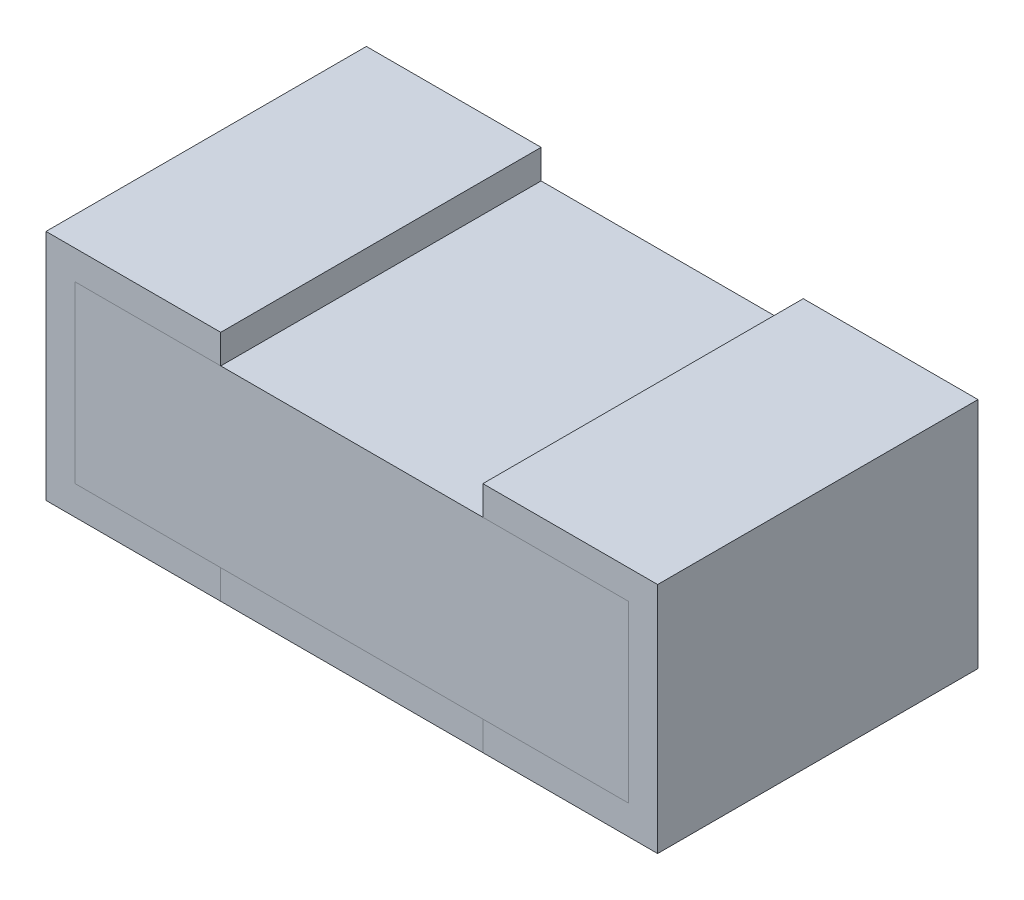
ISO-10303-21;
HEADER;
FILE_DESCRIPTION(('STEP AP214'),'2;1');
FILE_NAME('part.step','',(''),(''),'','','');
FILE_SCHEMA(('AUTOMOTIVE_DESIGN { 1 0 10303 214 1 1 1 1 }'));
ENDSEC;
DATA;
#1=APPLICATION_CONTEXT('core data for automotive mechanical design processes');
#2=APPLICATION_PROTOCOL_DEFINITION('international standard','automotive_design',2000,#1);
#3=PRODUCT_CONTEXT('',#1,'mechanical');
#4=PRODUCT('Part','Part','',(#3));
#5=PRODUCT_RELATED_PRODUCT_CATEGORY('part','',(#4));
#6=PRODUCT_DEFINITION_FORMATION('','',#4);
#7=PRODUCT_DEFINITION_CONTEXT('part definition',#1,'design');
#8=PRODUCT_DEFINITION('design','',#6,#7);
#9=PRODUCT_DEFINITION_SHAPE('','',#8);
#10=(LENGTH_UNIT() NAMED_UNIT(*) SI_UNIT(.MILLI.,.METRE.));
#11=(NAMED_UNIT(*) PLANE_ANGLE_UNIT() SI_UNIT($,.RADIAN.));
#12=(NAMED_UNIT(*) SI_UNIT($,.STERADIAN.) SOLID_ANGLE_UNIT());
#13=UNCERTAINTY_MEASURE_WITH_UNIT(LENGTH_MEASURE(1.E-05),#10,'distance_accuracy_value','');
#14=(GEOMETRIC_REPRESENTATION_CONTEXT(3) GLOBAL_UNCERTAINTY_ASSIGNED_CONTEXT((#13)) GLOBAL_UNIT_ASSIGNED_CONTEXT((#10,
#11,#12)) REPRESENTATION_CONTEXT('',''));
#15=CARTESIAN_POINT('',(0.,0.,0.));
#16=DIRECTION('',(0.,0.,1.));
#17=DIRECTION('',(1.,0.,0.));
#18=AXIS2_PLACEMENT_3D('',#15,#16,#17);
#19=CARTESIAN_POINT('',(0.999999999976395,0.35000000005278,0.));
#20=DIRECTION('',(1.,0.,0.));
#21=DIRECTION('',(0.,0.,-1.));
#22=AXIS2_PLACEMENT_3D('',#19,#20,#21);
#23=PLANE('',#22);
#24=DIRECTION('',(0.,1.,0.));
#25=VECTOR('',#24,1.);
#26=CARTESIAN_POINT('',(0.999999999976395,0.35000000005278,0.55));
#27=LINE('',#26,#25);
#28=CARTESIAN_POINT('',(0.999999999976395,0.049999999987449,0.55));
#29=VERTEX_POINT('',#28);
#30=CARTESIAN_POINT('',(0.999999999976395,0.35000000005278,0.55));
#31=VERTEX_POINT('',#30);
#32=EDGE_CURVE('E110',#29,#31,#27,.T.);
#33=ORIENTED_EDGE('',*,*,#32,.F.);
#34=DIRECTION('',(0.,0.,1.));
#35=VECTOR('',#34,1.);
#36=CARTESIAN_POINT('',(0.999999999976395,0.049999999987449,0.));
#37=LINE('',#36,#35);
#38=CARTESIAN_POINT('',(0.999999999976395,0.049999999987449,0.));
#39=VERTEX_POINT('',#38);
#40=EDGE_CURVE('E12',#39,#29,#37,.T.);
#41=ORIENTED_EDGE('',*,*,#40,.F.);
#42=DIRECTION('',(0.,1.,0.));
#43=VECTOR('',#42,1.);
#44=CARTESIAN_POINT('',(0.999999999976395,0.35000000005278,0.));
#45=LINE('',#44,#43);
#46=CARTESIAN_POINT('',(0.999999999976395,0.35000000005278,0.));
#47=VERTEX_POINT('',#46);
#48=EDGE_CURVE('E104',#39,#47,#45,.T.);
#49=ORIENTED_EDGE('',*,*,#48,.T.);
#50=DIRECTION('',(0.,0.,1.));
#51=VECTOR('',#50,1.);
#52=CARTESIAN_POINT('',(0.999999999976395,0.35000000005278,0.));
#53=LINE('',#52,#51);
#54=EDGE_CURVE('E49',#47,#31,#53,.T.);
#55=ORIENTED_EDGE('',*,*,#54,.T.);
#56=EDGE_LOOP('',(#33,#41,#49,#55));
#57=FACE_BOUND('',#56,.T.);
#58=ADVANCED_FACE('F46',(#57),#23,.T.);
#59=CARTESIAN_POINT('',(0.999999999976395,0.049999999987449,0.));
#60=DIRECTION('',(0.,-1.,0.));
#61=DIRECTION('',(0.,0.,-1.));
#62=AXIS2_PLACEMENT_3D('',#59,#60,#61);
#63=PLANE('',#62);
#64=DIRECTION('',(1.,0.,0.));
#65=VECTOR('',#64,1.);
#66=CARTESIAN_POINT('',(0.999999999976395,0.049999999987449,0.55));
#67=LINE('',#66,#65);
#68=CARTESIAN_POINT('',(0.0499999999873935,0.049999999987449,0.55));
#69=VERTEX_POINT('',#68);
#70=EDGE_CURVE('E106',#69,#29,#67,.T.);
#71=ORIENTED_EDGE('',*,*,#70,.F.);
#72=DIRECTION('',(0.,0.,1.));
#73=VECTOR('',#72,1.);
#74=CARTESIAN_POINT('',(0.0499999999873935,0.049999999987449,0.));
#75=LINE('',#74,#73);
#76=CARTESIAN_POINT('',(0.0499999999873935,0.049999999987449,0.));
#77=VERTEX_POINT('',#76);
#78=EDGE_CURVE('E55',#77,#69,#75,.T.);
#79=ORIENTED_EDGE('',*,*,#78,.F.);
#80=DIRECTION('',(1.,0.,0.));
#81=VECTOR('',#80,1.);
#82=CARTESIAN_POINT('',(0.999999999976395,0.049999999987449,0.));
#83=LINE('',#82,#81);
#84=EDGE_CURVE('E101',#77,#39,#83,.T.);
#85=ORIENTED_EDGE('',*,*,#84,.T.);
#86=ORIENTED_EDGE('',*,*,#40,.T.);
#87=EDGE_LOOP('',(#71,#79,#85,#86));
#88=FACE_BOUND('',#87,.T.);
#89=ADVANCED_FACE('F120',(#88),#63,.T.);
#90=CARTESIAN_POINT('',(0.0499999999873935,0.049999999987449,0.));
#91=DIRECTION('',(-1.,0.,0.));
#92=DIRECTION('',(0.,0.,1.));
#93=AXIS2_PLACEMENT_3D('',#90,#91,#92);
#94=PLANE('',#93);
#95=DIRECTION('',(0.,-1.,0.));
#96=VECTOR('',#95,1.);
#97=CARTESIAN_POINT('',(0.0499999999873935,0.049999999987449,0.55));
#98=LINE('',#97,#96);
#99=CARTESIAN_POINT('',(0.0499999999873935,0.350000000039305,0.55));
#100=VERTEX_POINT('',#99);
#101=EDGE_CURVE('E96',#100,#69,#98,.T.);
#102=ORIENTED_EDGE('',*,*,#101,.F.);
#103=DIRECTION('',(0.,0.,1.));
#104=VECTOR('',#103,1.);
#105=CARTESIAN_POINT('',(0.0499999999873935,0.350000000039305,0.));
#106=LINE('',#105,#104);
#107=CARTESIAN_POINT('',(0.0499999999873935,0.350000000039305,0.));
#108=VERTEX_POINT('',#107);
#109=EDGE_CURVE('E91',#108,#100,#106,.T.);
#110=ORIENTED_EDGE('',*,*,#109,.F.);
#111=DIRECTION('',(0.,-1.,0.));
#112=VECTOR('',#111,1.);
#113=CARTESIAN_POINT('',(0.0499999999873935,0.049999999987449,0.));
#114=LINE('',#113,#112);
#115=EDGE_CURVE('E94',#108,#77,#114,.T.);
#116=ORIENTED_EDGE('',*,*,#115,.T.);
#117=ORIENTED_EDGE('',*,*,#78,.T.);
#118=EDGE_LOOP('',(#102,#110,#116,#117));
#119=FACE_BOUND('',#118,.T.);
#120=ADVANCED_FACE('F93',(#119),#94,.T.);
#121=CARTESIAN_POINT('',(0.0499999999873935,0.350000000039305,0.));
#122=DIRECTION('',(-1.41845599595198E-11,1.,0.));
#123=DIRECTION('',(-1.,-1.41845599595198E-11,0.));
#124=AXIS2_PLACEMENT_3D('',#121,#122,#123);
#125=PLANE('',#124);
#126=DIRECTION('',(-1.,-1.41845599595198E-11,0.));
#127=VECTOR('',#126,1.);
#128=CARTESIAN_POINT('',(0.0499999999873935,0.350000000039305,0.55));
#129=LINE('',#128,#127);
#130=EDGE_CURVE('E113',#31,#100,#129,.T.);
#131=ORIENTED_EDGE('',*,*,#130,.F.);
#132=ORIENTED_EDGE('',*,*,#54,.F.);
#133=DIRECTION('',(-1.,-1.41845599595198E-11,0.));
#134=VECTOR('',#133,1.);
#135=CARTESIAN_POINT('',(0.0499999999873935,0.350000000039305,0.));
#136=LINE('',#135,#134);
#137=EDGE_CURVE('E100',#47,#108,#136,.T.);
#138=ORIENTED_EDGE('',*,*,#137,.T.);
#139=ORIENTED_EDGE('',*,*,#109,.T.);
#140=EDGE_LOOP('',(#131,#132,#138,#139));
#141=FACE_BOUND('',#140,.T.);
#142=ADVANCED_FACE('F103',(#141),#125,.T.);
#143=CARTESIAN_POINT('',(0.,0.,0.));
#144=DIRECTION('',(0.,0.,-1.));
#145=DIRECTION('',(-1.,0.,0.));
#146=AXIS2_PLACEMENT_3D('',#143,#144,#145);
#147=PLANE('',#146);
#148=ORIENTED_EDGE('',*,*,#48,.F.);
#149=ORIENTED_EDGE('',*,*,#84,.F.);
#150=ORIENTED_EDGE('',*,*,#115,.F.);
#151=ORIENTED_EDGE('',*,*,#137,.F.);
#152=EDGE_LOOP('',(#148,#149,#150,#151));
#153=FACE_BOUND('',#152,.T.);
#154=ADVANCED_FACE('F99',(#153),#147,.T.);
#155=CARTESIAN_POINT('',(0.,0.,0.55));
#156=DIRECTION('',(0.,0.,-1.));
#157=DIRECTION('',(-1.,0.,0.));
#158=AXIS2_PLACEMENT_3D('',#155,#156,#157);
#159=PLANE('',#158);
#160=ORIENTED_EDGE('',*,*,#32,.T.);
#161=ORIENTED_EDGE('',*,*,#130,.T.);
#162=ORIENTED_EDGE('',*,*,#101,.T.);
#163=ORIENTED_EDGE('',*,*,#70,.T.);
#164=EDGE_LOOP('',(#160,#161,#162,#163));
#165=FACE_BOUND('',#164,.T.);
#166=ADVANCED_FACE('F119',(#165),#159,.F.);
#167=CLOSED_SHELL('',(#58,#89,#120,#142,#154,#166));
#168=MANIFOLD_SOLID_BREP('B2',#167);
#169=CARTESIAN_POINT('',(0.749999999982299,0.049999999987449,0.));
#170=DIRECTION('',(1.,0.,0.));
#171=DIRECTION('',(0.,0.,-1.));
#172=AXIS2_PLACEMENT_3D('',#169,#170,#171);
#173=PLANE('',#172);
#174=DIRECTION('',(0.,1.,0.));
#175=VECTOR('',#174,1.);
#176=CARTESIAN_POINT('',(0.749999999982299,0.049999999987449,0.55));
#177=LINE('',#176,#175);
#178=CARTESIAN_POINT('',(0.749999999982299,0.,0.55));
#179=VERTEX_POINT('',#178);
#180=CARTESIAN_POINT('',(0.749999999982299,0.049999999987449,0.55));
#181=VERTEX_POINT('',#180);
#182=EDGE_CURVE('E244',#179,#181,#177,.T.);
#183=ORIENTED_EDGE('',*,*,#182,.F.);
#184=DIRECTION('',(0.,0.,1.));
#185=VECTOR('',#184,1.);
#186=CARTESIAN_POINT('',(0.749999999982299,0.,0.));
#187=LINE('',#186,#185);
#188=CARTESIAN_POINT('',(0.749999999982299,0.,0.));
#189=VERTEX_POINT('',#188);
#190=EDGE_CURVE('E44',#189,#179,#187,.T.);
#191=ORIENTED_EDGE('',*,*,#190,.F.);
#192=DIRECTION('',(0.,1.,0.));
#193=VECTOR('',#192,1.);
#194=CARTESIAN_POINT('',(0.749999999982299,0.049999999987449,0.));
#195=LINE('',#194,#193);
#196=CARTESIAN_POINT('',(0.749999999982299,0.049999999987449,0.));
#197=VERTEX_POINT('',#196);
#198=EDGE_CURVE('E238',#189,#197,#195,.T.);
#199=ORIENTED_EDGE('',*,*,#198,.T.);
#200=DIRECTION('',(0.,0.,1.));
#201=VECTOR('',#200,1.);
#202=CARTESIAN_POINT('',(0.749999999982299,0.049999999987449,0.));
#203=LINE('',#202,#201);
#204=EDGE_CURVE('E183',#197,#181,#203,.T.);
#205=ORIENTED_EDGE('',*,*,#204,.T.);
#206=EDGE_LOOP('',(#183,#191,#199,#205));
#207=FACE_BOUND('',#206,.T.);
#208=ADVANCED_FACE('F180',(#207),#173,.T.);
#209=CARTESIAN_POINT('',(0.749999999982299,0.,0.));
#210=DIRECTION('',(0.,-1.,0.));
#211=DIRECTION('',(0.,0.,-1.));
#212=AXIS2_PLACEMENT_3D('',#209,#210,#211);
#213=PLANE('',#212);
#214=DIRECTION('',(1.,0.,0.));
#215=VECTOR('',#214,1.);
#216=CARTESIAN_POINT('',(0.749999999982299,0.,0.55));
#217=LINE('',#216,#215);
#218=CARTESIAN_POINT('',(0.299999999981496,0.,0.55));
#219=VERTEX_POINT('',#218);
#220=EDGE_CURVE('E240',#219,#179,#217,.T.);
#221=ORIENTED_EDGE('',*,*,#220,.F.);
#222=DIRECTION('',(0.,0.,1.));
#223=VECTOR('',#222,1.);
#224=CARTESIAN_POINT('',(0.299999999981496,0.,0.));
#225=LINE('',#224,#223);
#226=CARTESIAN_POINT('',(0.299999999981496,0.,0.));
#227=VERTEX_POINT('',#226);
#228=EDGE_CURVE('E189',#227,#219,#225,.T.);
#229=ORIENTED_EDGE('',*,*,#228,.F.);
#230=DIRECTION('',(1.,0.,0.));
#231=VECTOR('',#230,1.);
#232=CARTESIAN_POINT('',(0.749999999982299,0.,0.));
#233=LINE('',#232,#231);
#234=EDGE_CURVE('E235',#227,#189,#233,.T.);
#235=ORIENTED_EDGE('',*,*,#234,.T.);
#236=ORIENTED_EDGE('',*,*,#190,.T.);
#237=EDGE_LOOP('',(#221,#229,#235,#236));
#238=FACE_BOUND('',#237,.T.);
#239=ADVANCED_FACE('F254',(#238),#213,.T.);
#240=CARTESIAN_POINT('',(0.299999999981496,0.,0.));
#241=DIRECTION('',(-1.,0.,0.));
#242=DIRECTION('',(0.,0.,1.));
#243=AXIS2_PLACEMENT_3D('',#240,#241,#242);
#244=PLANE('',#243);
#245=DIRECTION('',(0.,-1.,0.));
#246=VECTOR('',#245,1.);
#247=CARTESIAN_POINT('',(0.299999999981496,0.,0.55));
#248=LINE('',#247,#246);
#249=CARTESIAN_POINT('',(0.299999999981496,0.049999999987449,0.55));
#250=VERTEX_POINT('',#249);
#251=EDGE_CURVE('E230',#250,#219,#248,.T.);
#252=ORIENTED_EDGE('',*,*,#251,.F.);
#253=DIRECTION('',(0.,0.,1.));
#254=VECTOR('',#253,1.);
#255=CARTESIAN_POINT('',(0.299999999981496,0.049999999987449,0.));
#256=LINE('',#255,#254);
#257=CARTESIAN_POINT('',(0.299999999981496,0.049999999987449,0.));
#258=VERTEX_POINT('',#257);
#259=EDGE_CURVE('E225',#258,#250,#256,.T.);
#260=ORIENTED_EDGE('',*,*,#259,.F.);
#261=DIRECTION('',(0.,-1.,0.));
#262=VECTOR('',#261,1.);
#263=CARTESIAN_POINT('',(0.299999999981496,0.,0.));
#264=LINE('',#263,#262);
#265=EDGE_CURVE('E228',#258,#227,#264,.T.);
#266=ORIENTED_EDGE('',*,*,#265,.T.);
#267=ORIENTED_EDGE('',*,*,#228,.T.);
#268=EDGE_LOOP('',(#252,#260,#266,#267));
#269=FACE_BOUND('',#268,.T.);
#270=ADVANCED_FACE('F227',(#269),#244,.T.);
#271=CARTESIAN_POINT('',(0.299999999981496,0.049999999987449,0.));
#272=DIRECTION('',(0.,1.,0.));
#273=DIRECTION('',(0.,0.,1.));
#274=AXIS2_PLACEMENT_3D('',#271,#272,#273);
#275=PLANE('',#274);
#276=DIRECTION('',(-1.,0.,0.));
#277=VECTOR('',#276,1.);
#278=CARTESIAN_POINT('',(0.299999999981496,0.049999999987449,0.55));
#279=LINE('',#278,#277);
#280=EDGE_CURVE('E247',#181,#250,#279,.T.);
#281=ORIENTED_EDGE('',*,*,#280,.F.);
#282=ORIENTED_EDGE('',*,*,#204,.F.);
#283=DIRECTION('',(-1.,0.,0.));
#284=VECTOR('',#283,1.);
#285=CARTESIAN_POINT('',(0.299999999981496,0.049999999987449,0.));
#286=LINE('',#285,#284);
#287=EDGE_CURVE('E234',#197,#258,#286,.T.);
#288=ORIENTED_EDGE('',*,*,#287,.T.);
#289=ORIENTED_EDGE('',*,*,#259,.T.);
#290=EDGE_LOOP('',(#281,#282,#288,#289));
#291=FACE_BOUND('',#290,.T.);
#292=ADVANCED_FACE('F237',(#291),#275,.T.);
#293=CARTESIAN_POINT('',(0.,0.,0.));
#294=DIRECTION('',(0.,0.,-1.));
#295=DIRECTION('',(-1.,0.,0.));
#296=AXIS2_PLACEMENT_3D('',#293,#294,#295);
#297=PLANE('',#296);
#298=ORIENTED_EDGE('',*,*,#198,.F.);
#299=ORIENTED_EDGE('',*,*,#234,.F.);
#300=ORIENTED_EDGE('',*,*,#265,.F.);
#301=ORIENTED_EDGE('',*,*,#287,.F.);
#302=EDGE_LOOP('',(#298,#299,#300,#301));
#303=FACE_BOUND('',#302,.T.);
#304=ADVANCED_FACE('F233',(#303),#297,.T.);
#305=CARTESIAN_POINT('',(0.,0.,0.55));
#306=DIRECTION('',(0.,0.,-1.));
#307=DIRECTION('',(-1.,0.,0.));
#308=AXIS2_PLACEMENT_3D('',#305,#306,#307);
#309=PLANE('',#308);
#310=ORIENTED_EDGE('',*,*,#182,.T.);
#311=ORIENTED_EDGE('',*,*,#280,.T.);
#312=ORIENTED_EDGE('',*,*,#251,.T.);
#313=ORIENTED_EDGE('',*,*,#220,.T.);
#314=EDGE_LOOP('',(#310,#311,#312,#313));
#315=FACE_BOUND('',#314,.T.);
#316=ADVANCED_FACE('F253',(#315),#309,.F.);
#317=CLOSED_SHELL('',(#208,#239,#270,#292,#304,#316));
#318=MANIFOLD_SOLID_BREP('B6',#317);
#319=CARTESIAN_POINT('',(0.749999999982299,0.400000000040229,0.55));
#320=DIRECTION('',(1.,0.,0.));
#321=DIRECTION('',(0.,0.,-1.));
#322=AXIS2_PLACEMENT_3D('',#319,#320,#321);
#323=PLANE('',#322);
#324=DIRECTION('',(0.,-1.,0.));
#325=VECTOR('',#324,1.);
#326=CARTESIAN_POINT('',(0.749999999982299,0.400000000040229,0.));
#327=LINE('',#326,#325);
#328=CARTESIAN_POINT('',(0.749999999982299,0.400000000040229,0.));
#329=VERTEX_POINT('',#328);
#330=CARTESIAN_POINT('',(0.749999999982299,0.35000000005278,0.));
#331=VERTEX_POINT('',#330);
#332=EDGE_CURVE('E409',#329,#331,#327,.T.);
#333=ORIENTED_EDGE('',*,*,#332,.T.);
#334=DIRECTION('',(0.,0.,-1.));
#335=VECTOR('',#334,1.);
#336=CARTESIAN_POINT('',(0.749999999982299,0.35000000005278,0.55));
#337=LINE('',#336,#335);
#338=CARTESIAN_POINT('',(0.749999999982299,0.35000000005278,0.55));
#339=VERTEX_POINT('',#338);
#340=EDGE_CURVE('E178',#339,#331,#337,.T.);
#341=ORIENTED_EDGE('',*,*,#340,.F.);
#342=DIRECTION('',(0.,-1.,0.));
#343=VECTOR('',#342,1.);
#344=CARTESIAN_POINT('',(0.749999999982299,0.400000000040229,0.55));
#345=LINE('',#344,#343);
#346=CARTESIAN_POINT('',(0.749999999982299,0.400000000040229,0.55));
#347=VERTEX_POINT('',#346);
#348=EDGE_CURVE('E423',#347,#339,#345,.T.);
#349=ORIENTED_EDGE('',*,*,#348,.F.);
#350=DIRECTION('',(0.,0.,-1.));
#351=VECTOR('',#350,1.);
#352=CARTESIAN_POINT('',(0.749999999982299,0.400000000040229,0.55));
#353=LINE('',#352,#351);
#354=EDGE_CURVE('E405',#347,#329,#353,.T.);
#355=ORIENTED_EDGE('',*,*,#354,.T.);
#356=EDGE_LOOP('',(#333,#341,#349,#355));
#357=FACE_BOUND('',#356,.T.);
#358=ADVANCED_FACE('F313',(#357),#323,.F.);
#359=CARTESIAN_POINT('',(0.749999999982299,0.35000000005278,0.55));
#360=DIRECTION('',(0.,1.,0.));
#361=DIRECTION('',(0.,0.,1.));
#362=AXIS2_PLACEMENT_3D('',#359,#360,#361);
#363=PLANE('',#362);
#364=DIRECTION('',(1.,0.,0.));
#365=VECTOR('',#364,1.);
#366=CARTESIAN_POINT('',(0.749999999982299,0.35000000005278,0.));
#367=LINE('',#366,#365);
#368=CARTESIAN_POINT('',(0.999999999976395,0.35000000005278,0.));
#369=VERTEX_POINT('',#368);
#370=EDGE_CURVE('E412',#331,#369,#367,.T.);
#371=ORIENTED_EDGE('',*,*,#370,.T.);
#372=DIRECTION('',(0.,0.,-1.));
#373=VECTOR('',#372,1.);
#374=CARTESIAN_POINT('',(0.999999999976395,0.35000000005278,0.55));
#375=LINE('',#374,#373);
#376=CARTESIAN_POINT('',(0.999999999976395,0.35000000005278,0.55));
#377=VERTEX_POINT('',#376);
#378=EDGE_CURVE('E321',#377,#369,#375,.T.);
#379=ORIENTED_EDGE('',*,*,#378,.F.);
#380=DIRECTION('',(1.,0.,0.));
#381=VECTOR('',#380,1.);
#382=CARTESIAN_POINT('',(0.749999999982299,0.35000000005278,0.55));
#383=LINE('',#382,#381);
#384=EDGE_CURVE('E372',#339,#377,#383,.T.);
#385=ORIENTED_EDGE('',*,*,#384,.F.);
#386=ORIENTED_EDGE('',*,*,#340,.T.);
#387=EDGE_LOOP('',(#371,#379,#385,#386));
#388=FACE_BOUND('',#387,.T.);
#389=ADVANCED_FACE('F458',(#388),#363,.F.);
#390=CARTESIAN_POINT('',(0.999999999976395,0.35000000005278,0.55));
#391=DIRECTION('',(1.,0.,0.));
#392=DIRECTION('',(0.,0.,-1.));
#393=AXIS2_PLACEMENT_3D('',#390,#391,#392);
#394=PLANE('',#393);
#395=DIRECTION('',(0.,-1.,0.));
#396=VECTOR('',#395,1.);
#397=CARTESIAN_POINT('',(0.999999999976395,0.35000000005278,0.));
#398=LINE('',#397,#396);
#399=CARTESIAN_POINT('',(0.999999999976395,0.049999999987449,0.));
#400=VERTEX_POINT('',#399);
#401=EDGE_CURVE('E414',#369,#400,#398,.T.);
#402=ORIENTED_EDGE('',*,*,#401,.T.);
#403=DIRECTION('',(0.,0.,-1.));
#404=VECTOR('',#403,1.);
#405=CARTESIAN_POINT('',(0.999999999976395,0.049999999987449,0.55));
#406=LINE('',#405,#404);
#407=CARTESIAN_POINT('',(0.999999999976395,0.049999999987449,0.55));
#408=VERTEX_POINT('',#407);
#409=EDGE_CURVE('E430',#408,#400,#406,.T.);
#410=ORIENTED_EDGE('',*,*,#409,.F.);
#411=DIRECTION('',(0.,-1.,0.));
#412=VECTOR('',#411,1.);
#413=CARTESIAN_POINT('',(0.999999999976395,0.35000000005278,0.55));
#414=LINE('',#413,#412);
#415=EDGE_CURVE('E438',#377,#408,#414,.T.);
#416=ORIENTED_EDGE('',*,*,#415,.F.);
#417=ORIENTED_EDGE('',*,*,#378,.T.);
#418=EDGE_LOOP('',(#402,#410,#416,#417));
#419=FACE_BOUND('',#418,.T.);
#420=ADVANCED_FACE('F436',(#419),#394,.F.);
#421=CARTESIAN_POINT('',(0.999999999976395,0.049999999987449,0.55));
#422=DIRECTION('',(0.,-1.,0.));
#423=DIRECTION('',(0.,0.,-1.));
#424=AXIS2_PLACEMENT_3D('',#421,#422,#423);
#425=PLANE('',#424);
#426=DIRECTION('',(-1.,0.,0.));
#427=VECTOR('',#426,1.);
#428=CARTESIAN_POINT('',(0.999999999976395,0.049999999987449,0.));
#429=LINE('',#428,#427);
#430=CARTESIAN_POINT('',(0.749999999982299,0.049999999987449,0.));
#431=VERTEX_POINT('',#430);
#432=EDGE_CURVE('E416',#400,#431,#429,.T.);
#433=ORIENTED_EDGE('',*,*,#432,.T.);
#434=DIRECTION('',(0.,0.,-1.));
#435=VECTOR('',#434,1.);
#436=CARTESIAN_POINT('',(0.749999999982299,0.049999999987449,0.55));
#437=LINE('',#436,#435);
#438=CARTESIAN_POINT('',(0.749999999982299,0.049999999987449,0.55));
#439=VERTEX_POINT('',#438);
#440=EDGE_CURVE('E427',#439,#431,#437,.T.);
#441=ORIENTED_EDGE('',*,*,#440,.F.);
#442=DIRECTION('',(-1.,0.,0.));
#443=VECTOR('',#442,1.);
#444=CARTESIAN_POINT('',(0.999999999976395,0.049999999987449,0.55));
#445=LINE('',#444,#443);
#446=EDGE_CURVE('E450',#408,#439,#445,.T.);
#447=ORIENTED_EDGE('',*,*,#446,.F.);
#448=ORIENTED_EDGE('',*,*,#409,.T.);
#449=EDGE_LOOP('',(#433,#441,#447,#448));
#450=FACE_BOUND('',#449,.T.);
#451=ADVANCED_FACE('F446',(#450),#425,.F.);
#452=CARTESIAN_POINT('',(0.749999999982299,0.049999999987449,0.55));
#453=DIRECTION('',(1.,0.,0.));
#454=DIRECTION('',(0.,0.,-1.));
#455=AXIS2_PLACEMENT_3D('',#452,#453,#454);
#456=PLANE('',#455);
#457=DIRECTION('',(0.,-1.,0.));
#458=VECTOR('',#457,1.);
#459=CARTESIAN_POINT('',(0.749999999982299,0.049999999987449,0.));
#460=LINE('',#459,#458);
#461=CARTESIAN_POINT('',(0.749999999982299,0.,0.));
#462=VERTEX_POINT('',#461);
#463=EDGE_CURVE('E418',#431,#462,#460,.T.);
#464=ORIENTED_EDGE('',*,*,#463,.T.);
#465=DIRECTION('',(0.,0.,-1.));
#466=VECTOR('',#465,1.);
#467=CARTESIAN_POINT('',(0.749999999982299,0.,0.55));
#468=LINE('',#467,#466);
#469=CARTESIAN_POINT('',(0.749999999982299,0.,0.55));
#470=VERTEX_POINT('',#469);
#471=EDGE_CURVE('E400',#470,#462,#468,.T.);
#472=ORIENTED_EDGE('',*,*,#471,.F.);
#473=DIRECTION('',(0.,-1.,0.));
#474=VECTOR('',#473,1.);
#475=CARTESIAN_POINT('',(0.749999999982299,0.049999999987449,0.55));
#476=LINE('',#475,#474);
#477=EDGE_CURVE('E391',#439,#470,#476,.T.);
#478=ORIENTED_EDGE('',*,*,#477,.F.);
#479=ORIENTED_EDGE('',*,*,#440,.T.);
#480=EDGE_LOOP('',(#464,#472,#478,#479));
#481=FACE_BOUND('',#480,.T.);
#482=ADVANCED_FACE('F449',(#481),#456,.F.);
#483=CARTESIAN_POINT('',(0.749999999982299,0.,0.55));
#484=DIRECTION('',(0.,1.,0.));
#485=DIRECTION('',(0.,0.,1.));
#486=AXIS2_PLACEMENT_3D('',#483,#484,#485);
#487=PLANE('',#486);
#488=DIRECTION('',(1.,0.,0.));
#489=VECTOR('',#488,1.);
#490=CARTESIAN_POINT('',(0.749999999982299,0.,0.));
#491=LINE('',#490,#489);
#492=CARTESIAN_POINT('',(1.0499999999638,0.,0.));
#493=VERTEX_POINT('',#492);
#494=EDGE_CURVE('E399',#462,#493,#491,.T.);
#495=ORIENTED_EDGE('',*,*,#494,.T.);
#496=DIRECTION('',(0.,0.,-1.));
#497=VECTOR('',#496,1.);
#498=CARTESIAN_POINT('',(1.0499999999638,0.,0.55));
#499=LINE('',#498,#497);
#500=CARTESIAN_POINT('',(1.0499999999638,0.,0.55));
#501=VERTEX_POINT('',#500);
#502=EDGE_CURVE('E396',#501,#493,#499,.T.);
#503=ORIENTED_EDGE('',*,*,#502,.F.);
#504=DIRECTION('',(1.,0.,0.));
#505=VECTOR('',#504,1.);
#506=CARTESIAN_POINT('',(0.749999999982299,0.,0.55));
#507=LINE('',#506,#505);
#508=EDGE_CURVE('E385',#470,#501,#507,.T.);
#509=ORIENTED_EDGE('',*,*,#508,.F.);
#510=ORIENTED_EDGE('',*,*,#471,.T.);
#511=EDGE_LOOP('',(#495,#503,#509,#510));
#512=FACE_BOUND('',#511,.T.);
#513=ADVANCED_FACE('F397',(#512),#487,.F.);
#514=CARTESIAN_POINT('',(1.0499999999638,0.,0.55));
#515=DIRECTION('',(-1.,0.,0.));
#516=DIRECTION('',(0.,0.,1.));
#517=AXIS2_PLACEMENT_3D('',#514,#515,#516);
#518=PLANE('',#517);
#519=DIRECTION('',(0.,1.,0.));
#520=VECTOR('',#519,1.);
#521=CARTESIAN_POINT('',(1.0499999999638,0.,0.));
#522=LINE('',#521,#520);
#523=CARTESIAN_POINT('',(1.0499999999638,0.400000000040229,0.));
#524=VERTEX_POINT('',#523);
#525=EDGE_CURVE('E358',#493,#524,#522,.T.);
#526=ORIENTED_EDGE('',*,*,#525,.T.);
#527=DIRECTION('',(0.,0.,-1.));
#528=VECTOR('',#527,1.);
#529=CARTESIAN_POINT('',(1.0499999999638,0.400000000040229,0.55));
#530=LINE('',#529,#528);
#531=CARTESIAN_POINT('',(1.0499999999638,0.400000000040229,0.55));
#532=VERTEX_POINT('',#531);
#533=EDGE_CURVE('E401',#532,#524,#530,.T.);
#534=ORIENTED_EDGE('',*,*,#533,.F.);
#535=DIRECTION('',(0.,1.,0.));
#536=VECTOR('',#535,1.);
#537=CARTESIAN_POINT('',(1.0499999999638,0.,0.55));
#538=LINE('',#537,#536);
#539=EDGE_CURVE('E389',#501,#532,#538,.T.);
#540=ORIENTED_EDGE('',*,*,#539,.F.);
#541=ORIENTED_EDGE('',*,*,#502,.T.);
#542=EDGE_LOOP('',(#526,#534,#540,#541));
#543=FACE_BOUND('',#542,.T.);
#544=ADVANCED_FACE('F403',(#543),#518,.F.);
#545=CARTESIAN_POINT('',(1.0499999999638,0.400000000040229,0.55));
#546=DIRECTION('',(0.,-1.,0.));
#547=DIRECTION('',(0.,0.,-1.));
#548=AXIS2_PLACEMENT_3D('',#545,#546,#547);
#549=PLANE('',#548);
#550=DIRECTION('',(-1.,0.,0.));
#551=VECTOR('',#550,1.);
#552=CARTESIAN_POINT('',(1.0499999999638,0.400000000040229,0.));
#553=LINE('',#552,#551);
#554=EDGE_CURVE('E364',#524,#329,#553,.T.);
#555=ORIENTED_EDGE('',*,*,#554,.T.);
#556=ORIENTED_EDGE('',*,*,#354,.F.);
#557=DIRECTION('',(-1.,0.,0.));
#558=VECTOR('',#557,1.);
#559=CARTESIAN_POINT('',(1.0499999999638,0.400000000040229,0.55));
#560=LINE('',#559,#558);
#561=EDGE_CURVE('E329',#532,#347,#560,.T.);
#562=ORIENTED_EDGE('',*,*,#561,.F.);
#563=ORIENTED_EDGE('',*,*,#533,.T.);
#564=EDGE_LOOP('',(#555,#556,#562,#563));
#565=FACE_BOUND('',#564,.T.);
#566=ADVANCED_FACE('F474',(#565),#549,.F.);
#567=CARTESIAN_POINT('',(0.,0.,0.55));
#568=DIRECTION('',(0.,0.,1.));
#569=DIRECTION('',(1.,0.,0.));
#570=AXIS2_PLACEMENT_3D('',#567,#568,#569);
#571=PLANE('',#570);
#572=ORIENTED_EDGE('',*,*,#348,.T.);
#573=ORIENTED_EDGE('',*,*,#384,.T.);
#574=ORIENTED_EDGE('',*,*,#415,.T.);
#575=ORIENTED_EDGE('',*,*,#446,.T.);
#576=ORIENTED_EDGE('',*,*,#477,.T.);
#577=ORIENTED_EDGE('',*,*,#508,.T.);
#578=ORIENTED_EDGE('',*,*,#539,.T.);
#579=ORIENTED_EDGE('',*,*,#561,.T.);
#580=EDGE_LOOP('',(#572,#573,#574,#575,#576,#577,#578,#579));
#581=FACE_BOUND('',#580,.T.);
#582=ADVANCED_FACE('F387',(#581),#571,.T.);
#583=CARTESIAN_POINT('',(0.,0.,0.));
#584=DIRECTION('',(0.,0.,1.));
#585=DIRECTION('',(1.,0.,0.));
#586=AXIS2_PLACEMENT_3D('',#583,#584,#585);
#587=PLANE('',#586);
#588=ORIENTED_EDGE('',*,*,#332,.F.);
#589=ORIENTED_EDGE('',*,*,#554,.F.);
#590=ORIENTED_EDGE('',*,*,#525,.F.);
#591=ORIENTED_EDGE('',*,*,#494,.F.);
#592=ORIENTED_EDGE('',*,*,#463,.F.);
#593=ORIENTED_EDGE('',*,*,#432,.F.);
#594=ORIENTED_EDGE('',*,*,#401,.F.);
#595=ORIENTED_EDGE('',*,*,#370,.F.);
#596=EDGE_LOOP('',(#588,#589,#590,#591,#592,#593,#594,#595));
#597=FACE_BOUND('',#596,.T.);
#598=ADVANCED_FACE('F442',(#597),#587,.F.);
#599=CLOSED_SHELL('',(#358,#389,#420,#451,#482,#513,#544,#566,#582,#598));
#600=MANIFOLD_SOLID_BREP('B38',#599);
#601=CARTESIAN_POINT('',(0.299999999981496,0.,0.55));
#602=DIRECTION('',(-1.,0.,0.));
#603=DIRECTION('',(0.,0.,1.));
#604=AXIS2_PLACEMENT_3D('',#601,#602,#603);
#605=PLANE('',#604);
#606=DIRECTION('',(0.,1.,0.));
#607=VECTOR('',#606,1.);
#608=CARTESIAN_POINT('',(0.299999999981496,0.,0.));
#609=LINE('',#608,#607);
#610=CARTESIAN_POINT('',(0.299999999981496,0.,0.));
#611=VERTEX_POINT('',#610);
#612=CARTESIAN_POINT('',(0.299999999981496,0.049999999987449,0.));
#613=VERTEX_POINT('',#612);
#614=EDGE_CURVE('E637',#611,#613,#609,.T.);
#615=ORIENTED_EDGE('',*,*,#614,.T.);
#616=DIRECTION('',(0.,0.,-1.));
#617=VECTOR('',#616,1.);
#618=CARTESIAN_POINT('',(0.299999999981496,0.049999999987449,0.55));
#619=LINE('',#618,#617);
#620=CARTESIAN_POINT('',(0.299999999981496,0.049999999987449,0.55));
#621=VERTEX_POINT('',#620);
#622=EDGE_CURVE('E311',#621,#613,#619,.T.);
#623=ORIENTED_EDGE('',*,*,#622,.F.);
#624=DIRECTION('',(0.,1.,0.));
#625=VECTOR('',#624,1.);
#626=CARTESIAN_POINT('',(0.299999999981496,0.,0.55));
#627=LINE('',#626,#625);
#628=CARTESIAN_POINT('',(0.299999999981496,0.,0.55));
#629=VERTEX_POINT('',#628);
#630=EDGE_CURVE('E651',#629,#621,#627,.T.);
#631=ORIENTED_EDGE('',*,*,#630,.F.);
#632=DIRECTION('',(0.,0.,-1.));
#633=VECTOR('',#632,1.);
#634=CARTESIAN_POINT('',(0.299999999981496,0.,0.55));
#635=LINE('',#634,#633);
#636=EDGE_CURVE('E633',#629,#611,#635,.T.);
#637=ORIENTED_EDGE('',*,*,#636,.T.);
#638=EDGE_LOOP('',(#615,#623,#631,#637));
#639=FACE_BOUND('',#638,.T.);
#640=ADVANCED_FACE('F541',(#639),#605,.F.);
#641=CARTESIAN_POINT('',(0.299999999981496,0.049999999987449,0.55));
#642=DIRECTION('',(0.,-1.,0.));
#643=DIRECTION('',(0.,0.,-1.));
#644=AXIS2_PLACEMENT_3D('',#641,#642,#643);
#645=PLANE('',#644);
#646=DIRECTION('',(-1.,0.,0.));
#647=VECTOR('',#646,1.);
#648=CARTESIAN_POINT('',(0.299999999981496,0.049999999987449,0.));
#649=LINE('',#648,#647);
#650=CARTESIAN_POINT('',(0.0499999999873935,0.049999999987449,0.));
#651=VERTEX_POINT('',#650);
#652=EDGE_CURVE('E640',#613,#651,#649,.T.);
#653=ORIENTED_EDGE('',*,*,#652,.T.);
#654=DIRECTION('',(0.,0.,-1.));
#655=VECTOR('',#654,1.);
#656=CARTESIAN_POINT('',(0.0499999999873935,0.049999999987449,0.55));
#657=LINE('',#656,#655);
#658=CARTESIAN_POINT('',(0.0499999999873935,0.049999999987449,0.55));
#659=VERTEX_POINT('',#658);
#660=EDGE_CURVE('E549',#659,#651,#657,.T.);
#661=ORIENTED_EDGE('',*,*,#660,.F.);
#662=DIRECTION('',(-1.,0.,0.));
#663=VECTOR('',#662,1.);
#664=CARTESIAN_POINT('',(0.299999999981496,0.049999999987449,0.55));
#665=LINE('',#664,#663);
#666=EDGE_CURVE('E600',#621,#659,#665,.T.);
#667=ORIENTED_EDGE('',*,*,#666,.F.);
#668=ORIENTED_EDGE('',*,*,#622,.T.);
#669=EDGE_LOOP('',(#653,#661,#667,#668));
#670=FACE_BOUND('',#669,.T.);
#671=ADVANCED_FACE('F686',(#670),#645,.F.);
#672=CARTESIAN_POINT('',(0.0499999999873935,0.049999999987449,0.55));
#673=DIRECTION('',(-1.,0.,0.));
#674=DIRECTION('',(0.,0.,1.));
#675=AXIS2_PLACEMENT_3D('',#672,#673,#674);
#676=PLANE('',#675);
#677=DIRECTION('',(0.,1.,0.));
#678=VECTOR('',#677,1.);
#679=CARTESIAN_POINT('',(0.0499999999873935,0.049999999987449,0.));
#680=LINE('',#679,#678);
#681=CARTESIAN_POINT('',(0.0499999999873935,0.350000000039305,0.));
#682=VERTEX_POINT('',#681);
#683=EDGE_CURVE('E642',#651,#682,#680,.T.);
#684=ORIENTED_EDGE('',*,*,#683,.T.);
#685=DIRECTION('',(0.,0.,-1.));
#686=VECTOR('',#685,1.);
#687=CARTESIAN_POINT('',(0.0499999999873935,0.350000000039305,0.55));
#688=LINE('',#687,#686);
#689=CARTESIAN_POINT('',(0.0499999999873935,0.350000000039305,0.55));
#690=VERTEX_POINT('',#689);
#691=EDGE_CURVE('E658',#690,#682,#688,.T.);
#692=ORIENTED_EDGE('',*,*,#691,.F.);
#693=DIRECTION('',(0.,1.,0.));
#694=VECTOR('',#693,1.);
#695=CARTESIAN_POINT('',(0.0499999999873935,0.049999999987449,0.55));
#696=LINE('',#695,#694);
#697=EDGE_CURVE('E666',#659,#690,#696,.T.);
#698=ORIENTED_EDGE('',*,*,#697,.F.);
#699=ORIENTED_EDGE('',*,*,#660,.T.);
#700=EDGE_LOOP('',(#684,#692,#698,#699));
#701=FACE_BOUND('',#700,.T.);
#702=ADVANCED_FACE('F664',(#701),#676,.F.);
#703=CARTESIAN_POINT('',(0.0499999999873935,0.350000000039305,0.55));
#704=DIRECTION('',(0.,1.,0.));
#705=DIRECTION('',(0.,0.,1.));
#706=AXIS2_PLACEMENT_3D('',#703,#704,#705);
#707=PLANE('',#706);
#708=DIRECTION('',(1.,0.,0.));
#709=VECTOR('',#708,1.);
#710=CARTESIAN_POINT('',(0.0499999999873935,0.350000000039305,0.));
#711=LINE('',#710,#709);
#712=CARTESIAN_POINT('',(0.299999999981496,0.350000000039305,0.));
#713=VERTEX_POINT('',#712);
#714=EDGE_CURVE('E644',#682,#713,#711,.T.);
#715=ORIENTED_EDGE('',*,*,#714,.T.);
#716=DIRECTION('',(0.,0.,-1.));
#717=VECTOR('',#716,1.);
#718=CARTESIAN_POINT('',(0.299999999981496,0.350000000039305,0.55));
#719=LINE('',#718,#717);
#720=CARTESIAN_POINT('',(0.299999999981496,0.350000000039305,0.55));
#721=VERTEX_POINT('',#720);
#722=EDGE_CURVE('E655',#721,#713,#719,.T.);
#723=ORIENTED_EDGE('',*,*,#722,.F.);
#724=DIRECTION('',(1.,0.,0.));
#725=VECTOR('',#724,1.);
#726=CARTESIAN_POINT('',(0.0499999999873935,0.350000000039305,0.55));
#727=LINE('',#726,#725);
#728=EDGE_CURVE('E678',#690,#721,#727,.T.);
#729=ORIENTED_EDGE('',*,*,#728,.F.);
#730=ORIENTED_EDGE('',*,*,#691,.T.);
#731=EDGE_LOOP('',(#715,#723,#729,#730));
#732=FACE_BOUND('',#731,.T.);
#733=ADVANCED_FACE('F674',(#732),#707,.F.);
#734=CARTESIAN_POINT('',(0.299999999981496,0.350000000039305,0.55));
#735=DIRECTION('',(-1.,0.,0.));
#736=DIRECTION('',(0.,0.,1.));
#737=AXIS2_PLACEMENT_3D('',#734,#735,#736);
#738=PLANE('',#737);
#739=DIRECTION('',(0.,1.,0.));
#740=VECTOR('',#739,1.);
#741=CARTESIAN_POINT('',(0.299999999981496,0.350000000039305,0.));
#742=LINE('',#741,#740);
#743=CARTESIAN_POINT('',(0.299999999981496,0.400000000013279,0.));
#744=VERTEX_POINT('',#743);
#745=EDGE_CURVE('E646',#713,#744,#742,.T.);
#746=ORIENTED_EDGE('',*,*,#745,.T.);
#747=DIRECTION('',(0.,0.,-1.));
#748=VECTOR('',#747,1.);
#749=CARTESIAN_POINT('',(0.299999999981496,0.400000000013279,0.55));
#750=LINE('',#749,#748);
#751=CARTESIAN_POINT('',(0.299999999981496,0.400000000013279,0.55));
#752=VERTEX_POINT('',#751);
#753=EDGE_CURVE('E628',#752,#744,#750,.T.);
#754=ORIENTED_EDGE('',*,*,#753,.F.);
#755=DIRECTION('',(0.,1.,0.));
#756=VECTOR('',#755,1.);
#757=CARTESIAN_POINT('',(0.299999999981496,0.350000000039305,0.55));
#758=LINE('',#757,#756);
#759=EDGE_CURVE('E619',#721,#752,#758,.T.);
#760=ORIENTED_EDGE('',*,*,#759,.F.);
#761=ORIENTED_EDGE('',*,*,#722,.T.);
#762=EDGE_LOOP('',(#746,#754,#760,#761));
#763=FACE_BOUND('',#762,.T.);
#764=ADVANCED_FACE('F677',(#763),#738,.F.);
#765=CARTESIAN_POINT('',(0.299999999981496,0.400000000013279,0.55));
#766=DIRECTION('',(0.,-1.,0.));
#767=DIRECTION('',(0.,0.,-1.));
#768=AXIS2_PLACEMENT_3D('',#765,#766,#767);
#769=PLANE('',#768);
#770=DIRECTION('',(-1.,0.,0.));
#771=VECTOR('',#770,1.);
#772=CARTESIAN_POINT('',(0.299999999981496,0.400000000013279,0.));
#773=LINE('',#772,#771);
#774=CARTESIAN_POINT('',(0.,0.400000000013279,0.));
#775=VERTEX_POINT('',#774);
#776=EDGE_CURVE('E627',#744,#775,#773,.T.);
#777=ORIENTED_EDGE('',*,*,#776,.T.);
#778=DIRECTION('',(0.,0.,-1.));
#779=VECTOR('',#778,1.);
#780=CARTESIAN_POINT('',(0.,0.400000000013279,0.55));
#781=LINE('',#780,#779);
#782=CARTESIAN_POINT('',(0.,0.400000000013279,0.55));
#783=VERTEX_POINT('',#782);
#784=EDGE_CURVE('E624',#783,#775,#781,.T.);
#785=ORIENTED_EDGE('',*,*,#784,.F.);
#786=DIRECTION('',(-1.,0.,0.));
#787=VECTOR('',#786,1.);
#788=CARTESIAN_POINT('',(0.299999999981496,0.400000000013279,0.55));
#789=LINE('',#788,#787);
#790=EDGE_CURVE('E613',#752,#783,#789,.T.);
#791=ORIENTED_EDGE('',*,*,#790,.F.);
#792=ORIENTED_EDGE('',*,*,#753,.T.);
#793=EDGE_LOOP('',(#777,#785,#791,#792));
#794=FACE_BOUND('',#793,.T.);
#795=ADVANCED_FACE('F625',(#794),#769,.F.);
#796=CARTESIAN_POINT('',(0.,0.400000000013279,0.55));
#797=DIRECTION('',(1.,0.,0.));
#798=DIRECTION('',(0.,0.,-1.));
#799=AXIS2_PLACEMENT_3D('',#796,#797,#798);
#800=PLANE('',#799);
#801=DIRECTION('',(0.,-1.,0.));
#802=VECTOR('',#801,1.);
#803=CARTESIAN_POINT('',(0.,0.400000000013279,0.));
#804=LINE('',#803,#802);
#805=CARTESIAN_POINT('',(0.,0.,0.));
#806=VERTEX_POINT('',#805);
#807=EDGE_CURVE('E586',#775,#806,#804,.T.);
#808=ORIENTED_EDGE('',*,*,#807,.T.);
#809=DIRECTION('',(0.,0.,-1.));
#810=VECTOR('',#809,1.);
#811=CARTESIAN_POINT('',(0.,0.,0.55));
#812=LINE('',#811,#810);
#813=CARTESIAN_POINT('',(0.,0.,0.55));
#814=VERTEX_POINT('',#813);
#815=EDGE_CURVE('E629',#814,#806,#812,.T.);
#816=ORIENTED_EDGE('',*,*,#815,.F.);
#817=DIRECTION('',(0.,-1.,0.));
#818=VECTOR('',#817,1.);
#819=CARTESIAN_POINT('',(0.,0.400000000013279,0.55));
#820=LINE('',#819,#818);
#821=EDGE_CURVE('E617',#783,#814,#820,.T.);
#822=ORIENTED_EDGE('',*,*,#821,.F.);
#823=ORIENTED_EDGE('',*,*,#784,.T.);
#824=EDGE_LOOP('',(#808,#816,#822,#823));
#825=FACE_BOUND('',#824,.T.);
#826=ADVANCED_FACE('F631',(#825),#800,.F.);
#827=CARTESIAN_POINT('',(0.,0.,0.55));
#828=DIRECTION('',(0.,1.,0.));
#829=DIRECTION('',(0.,0.,1.));
#830=AXIS2_PLACEMENT_3D('',#827,#828,#829);
#831=PLANE('',#830);
#832=DIRECTION('',(1.,0.,0.));
#833=VECTOR('',#832,1.);
#834=CARTESIAN_POINT('',(0.,0.,0.));
#835=LINE('',#834,#833);
#836=EDGE_CURVE('E592',#806,#611,#835,.T.);
#837=ORIENTED_EDGE('',*,*,#836,.T.);
#838=ORIENTED_EDGE('',*,*,#636,.F.);
#839=DIRECTION('',(1.,0.,0.));
#840=VECTOR('',#839,1.);
#841=CARTESIAN_POINT('',(0.,0.,0.55));
#842=LINE('',#841,#840);
#843=EDGE_CURVE('E557',#814,#629,#842,.T.);
#844=ORIENTED_EDGE('',*,*,#843,.F.);
#845=ORIENTED_EDGE('',*,*,#815,.T.);
#846=EDGE_LOOP('',(#837,#838,#844,#845));
#847=FACE_BOUND('',#846,.T.);
#848=ADVANCED_FACE('F702',(#847),#831,.F.);
#849=CARTESIAN_POINT('',(0.,0.,0.55));
#850=DIRECTION('',(0.,0.,1.));
#851=DIRECTION('',(1.,0.,0.));
#852=AXIS2_PLACEMENT_3D('',#849,#850,#851);
#853=PLANE('',#852);
#854=ORIENTED_EDGE('',*,*,#630,.T.);
#855=ORIENTED_EDGE('',*,*,#666,.T.);
#856=ORIENTED_EDGE('',*,*,#697,.T.);
#857=ORIENTED_EDGE('',*,*,#728,.T.);
#858=ORIENTED_EDGE('',*,*,#759,.T.);
#859=ORIENTED_EDGE('',*,*,#790,.T.);
#860=ORIENTED_EDGE('',*,*,#821,.T.);
#861=ORIENTED_EDGE('',*,*,#843,.T.);
#862=EDGE_LOOP('',(#854,#855,#856,#857,#858,#859,#860,#861));
#863=FACE_BOUND('',#862,.T.);
#864=ADVANCED_FACE('F615',(#863),#853,.T.);
#865=CARTESIAN_POINT('',(0.,0.,0.));
#866=DIRECTION('',(0.,0.,1.));
#867=DIRECTION('',(1.,0.,0.));
#868=AXIS2_PLACEMENT_3D('',#865,#866,#867);
#869=PLANE('',#868);
#870=ORIENTED_EDGE('',*,*,#614,.F.);
#871=ORIENTED_EDGE('',*,*,#836,.F.);
#872=ORIENTED_EDGE('',*,*,#807,.F.);
#873=ORIENTED_EDGE('',*,*,#776,.F.);
#874=ORIENTED_EDGE('',*,*,#745,.F.);
#875=ORIENTED_EDGE('',*,*,#714,.F.);
#876=ORIENTED_EDGE('',*,*,#683,.F.);
#877=ORIENTED_EDGE('',*,*,#652,.F.);
#878=EDGE_LOOP('',(#870,#871,#872,#873,#874,#875,#876,#877));
#879=FACE_BOUND('',#878,.T.);
#880=ADVANCED_FACE('F670',(#879),#869,.F.);
#881=CLOSED_SHELL('',(#640,#671,#702,#733,#764,#795,#826,#848,#864,#880));
#882=MANIFOLD_SOLID_BREP('B172',#881);
#883=ADVANCED_BREP_SHAPE_REPRESENTATION('',(#18,#168,#318,#600,#882),#14);
#884=SHAPE_DEFINITION_REPRESENTATION(#9,#883);
ENDSEC;
END-ISO-10303-21;
